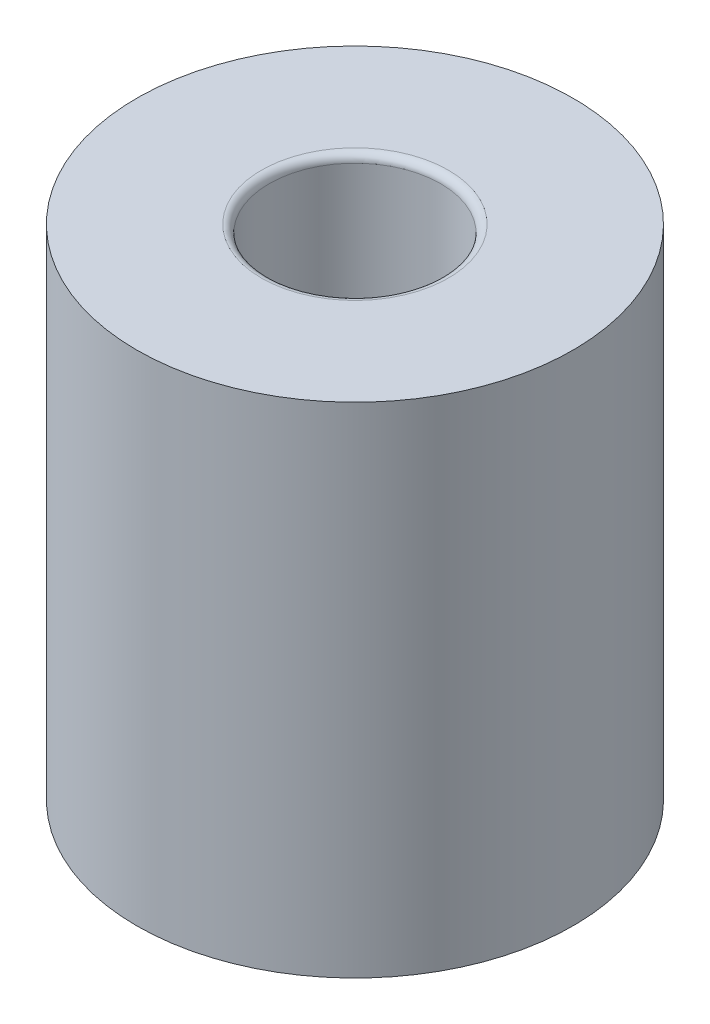
ISO-10303-21;
HEADER;
FILE_DESCRIPTION(('STEP AP214'),'2;1');
FILE_NAME('part.step','',(''),(''),'','','');
FILE_SCHEMA(('AUTOMOTIVE_DESIGN { 1 0 10303 214 1 1 1 1 }'));
ENDSEC;
DATA;
#1=APPLICATION_CONTEXT('core data for automotive mechanical design processes');
#2=APPLICATION_PROTOCOL_DEFINITION('international standard','automotive_design',2000,#1);
#3=PRODUCT_CONTEXT('',#1,'mechanical');
#4=PRODUCT('Part','Part','',(#3));
#5=PRODUCT_RELATED_PRODUCT_CATEGORY('part','',(#4));
#6=PRODUCT_DEFINITION_FORMATION('','',#4);
#7=PRODUCT_DEFINITION_CONTEXT('part definition',#1,'design');
#8=PRODUCT_DEFINITION('design','',#6,#7);
#9=PRODUCT_DEFINITION_SHAPE('','',#8);
#10=(LENGTH_UNIT() NAMED_UNIT(*) SI_UNIT(.MILLI.,.METRE.));
#11=(NAMED_UNIT(*) PLANE_ANGLE_UNIT() SI_UNIT($,.RADIAN.));
#12=(NAMED_UNIT(*) SI_UNIT($,.STERADIAN.) SOLID_ANGLE_UNIT());
#13=UNCERTAINTY_MEASURE_WITH_UNIT(LENGTH_MEASURE(1.E-05),#10,'distance_accuracy_value','');
#14=(GEOMETRIC_REPRESENTATION_CONTEXT(3) GLOBAL_UNCERTAINTY_ASSIGNED_CONTEXT((#13)) GLOBAL_UNIT_ASSIGNED_CONTEXT((#10,
#11,#12)) REPRESENTATION_CONTEXT('',''));
#15=CARTESIAN_POINT('',(0.,0.,0.));
#16=DIRECTION('',(0.,0.,1.));
#17=DIRECTION('',(1.,0.,0.));
#18=AXIS2_PLACEMENT_3D('',#15,#16,#17);
#19=CARTESIAN_POINT('',(0.,8.,0.));
#20=DIRECTION('',(0.,-1.,0.));
#21=DIRECTION('',(0.,0.,-1.));
#22=AXIS2_PLACEMENT_3D('',#19,#20,#21);
#23=CYLINDRICAL_SURFACE('',#22,3.5);
#24=CARTESIAN_POINT('',(0.,8.,0.));
#25=DIRECTION('',(0.,1.,0.));
#26=DIRECTION('',(0.,0.,1.));
#27=AXIS2_PLACEMENT_3D('',#24,#25,#26);
#28=CIRCLE('',#27,3.5);
#29=CARTESIAN_POINT('',(0.,8.,3.5));
#30=VERTEX_POINT('',#29);
#31=EDGE_CURVE('E61',#30,#30,#28,.T.);
#32=ORIENTED_EDGE('',*,*,#31,.F.);
#33=EDGE_LOOP('',(#32));
#34=FACE_BOUND('',#33,.T.);
#35=CARTESIAN_POINT('',(0.,0.,0.));
#36=DIRECTION('',(0.,1.,0.));
#37=DIRECTION('',(0.,0.,1.));
#38=AXIS2_PLACEMENT_3D('',#35,#36,#37);
#39=CIRCLE('',#38,3.5);
#40=CARTESIAN_POINT('',(0.,0.,3.5));
#41=VERTEX_POINT('',#40);
#42=EDGE_CURVE('E62',#41,#41,#39,.T.);
#43=ORIENTED_EDGE('',*,*,#42,.T.);
#44=EDGE_LOOP('',(#43));
#45=FACE_BOUND('',#44,.T.);
#46=ADVANCED_FACE('F37',(#34,#45),#23,.T.);
#47=CARTESIAN_POINT('',(0.,8.,0.));
#48=DIRECTION('',(0.,1.,0.));
#49=DIRECTION('',(0.,0.,1.));
#50=AXIS2_PLACEMENT_3D('',#47,#48,#49);
#51=PLANE('',#50);
#52=CARTESIAN_POINT('',(0.,8.,0.));
#53=DIRECTION('',(0.,1.,0.));
#54=DIRECTION('',(0.,0.,1.));
#55=AXIS2_PLACEMENT_3D('',#52,#53,#54);
#56=CIRCLE('',#55,1.5);
#57=CARTESIAN_POINT('',(0.,8.,1.5));
#58=VERTEX_POINT('',#57);
#59=EDGE_CURVE('E10',#58,#58,#56,.F.);
#60=ORIENTED_EDGE('',*,*,#59,.T.);
#61=EDGE_LOOP('',(#60));
#62=FACE_BOUND('',#61,.T.);
#63=ORIENTED_EDGE('',*,*,#31,.T.);
#64=EDGE_LOOP('',(#63));
#65=FACE_BOUND('',#64,.T.);
#66=ADVANCED_FACE('F70',(#62,#65),#51,.T.);
#67=CARTESIAN_POINT('',(0.,0.,0.));
#68=DIRECTION('',(0.,1.,0.));
#69=DIRECTION('',(0.,0.,1.));
#70=AXIS2_PLACEMENT_3D('',#67,#68,#69);
#71=PLANE('',#70);
#72=CARTESIAN_POINT('',(0.,0.,0.));
#73=DIRECTION('',(0.,1.,0.));
#74=DIRECTION('',(0.,0.,1.));
#75=AXIS2_PLACEMENT_3D('',#72,#73,#74);
#76=CIRCLE('',#75,1.5);
#77=CARTESIAN_POINT('',(0.,0.,1.5));
#78=VERTEX_POINT('',#77);
#79=EDGE_CURVE('E55',#78,#78,#76,.T.);
#80=ORIENTED_EDGE('',*,*,#79,.T.);
#81=EDGE_LOOP('',(#80));
#82=FACE_BOUND('',#81,.T.);
#83=ORIENTED_EDGE('',*,*,#42,.F.);
#84=EDGE_LOOP('',(#83));
#85=FACE_BOUND('',#84,.T.);
#86=ADVANCED_FACE('F77',(#82,#85),#71,.F.);
#87=CARTESIAN_POINT('',(0.,0.,0.));
#88=DIRECTION('',(0.,1.,0.));
#89=DIRECTION('',(0.,0.,1.));
#90=AXIS2_PLACEMENT_3D('',#87,#88,#89);
#91=CYLINDRICAL_SURFACE('',#90,1.375);
#92=CARTESIAN_POINT('',(0.,0.125,0.));
#93=DIRECTION('',(0.,1.,0.));
#94=DIRECTION('',(0.,0.,1.));
#95=AXIS2_PLACEMENT_3D('',#92,#93,#94);
#96=CIRCLE('',#95,1.375);
#97=CARTESIAN_POINT('',(0.,0.125,1.375));
#98=VERTEX_POINT('',#97);
#99=EDGE_CURVE('E45',#98,#98,#96,.F.);
#100=ORIENTED_EDGE('',*,*,#99,.T.);
#101=EDGE_LOOP('',(#100));
#102=FACE_BOUND('',#101,.T.);
#103=CARTESIAN_POINT('',(0.,7.875,0.));
#104=DIRECTION('',(0.,1.,0.));
#105=DIRECTION('',(0.,0.,1.));
#106=AXIS2_PLACEMENT_3D('',#103,#104,#105);
#107=CIRCLE('',#106,1.375);
#108=CARTESIAN_POINT('',(0.,7.875,1.375));
#109=VERTEX_POINT('',#108);
#110=EDGE_CURVE('E50',#109,#109,#107,.T.);
#111=ORIENTED_EDGE('',*,*,#110,.T.);
#112=EDGE_LOOP('',(#111));
#113=FACE_BOUND('',#112,.T.);
#114=ADVANCED_FACE('F79',(#102,#113),#91,.F.);
#115=CARTESIAN_POINT('',(0.,0.125,0.));
#116=DIRECTION('',(0.,1.,0.));
#117=DIRECTION('',(0.,0.,1.));
#118=AXIS2_PLACEMENT_3D('',#115,#116,#117);
#119=TOROIDAL_SURFACE('',#118,1.5,0.125);
#120=ORIENTED_EDGE('',*,*,#99,.F.);
#121=EDGE_LOOP('',(#120));
#122=FACE_BOUND('',#121,.T.);
#123=ORIENTED_EDGE('',*,*,#79,.F.);
#124=EDGE_LOOP('',(#123));
#125=FACE_BOUND('',#124,.T.);
#126=ADVANCED_FACE('F86',(#122,#125),#119,.T.);
#127=CARTESIAN_POINT('',(0.,7.875,0.));
#128=DIRECTION('',(0.,1.,0.));
#129=DIRECTION('',(0.,0.,1.));
#130=AXIS2_PLACEMENT_3D('',#127,#128,#129);
#131=TOROIDAL_SURFACE('',#130,1.5,0.125);
#132=ORIENTED_EDGE('',*,*,#59,.F.);
#133=EDGE_LOOP('',(#132));
#134=FACE_BOUND('',#133,.T.);
#135=ORIENTED_EDGE('',*,*,#110,.F.);
#136=EDGE_LOOP('',(#135));
#137=FACE_BOUND('',#136,.T.);
#138=ADVANCED_FACE('F39',(#134,#137),#131,.T.);
#139=CLOSED_SHELL('',(#46,#66,#86,#114,#126,#138));
#140=MANIFOLD_SOLID_BREP('B2',#139);
#141=ADVANCED_BREP_SHAPE_REPRESENTATION('',(#18,#140),#14);
#142=SHAPE_DEFINITION_REPRESENTATION(#9,#141);
ENDSEC;
END-ISO-10303-21;
